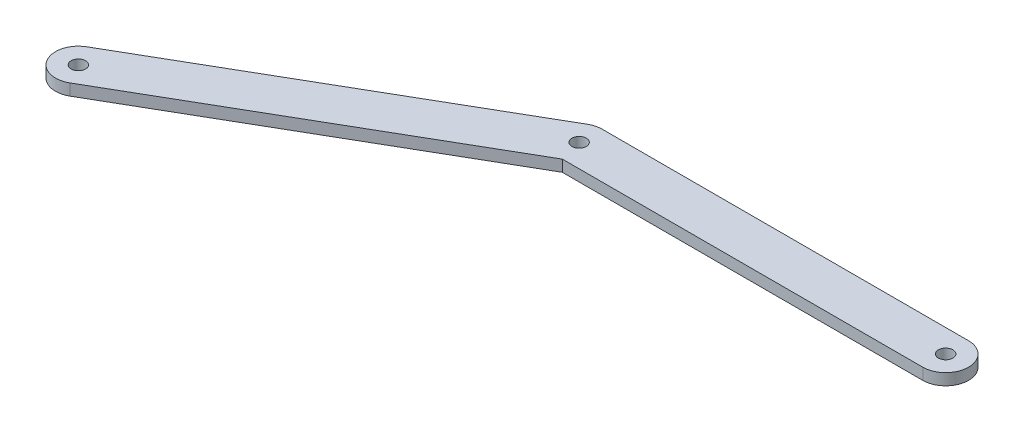
ISO-10303-21;
HEADER;
FILE_DESCRIPTION(('STEP AP214'),'2;1');
FILE_NAME('part.step','',(''),(''),'','','');
FILE_SCHEMA(('AUTOMOTIVE_DESIGN { 1 0 10303 214 1 1 1 1 }'));
ENDSEC;
DATA;
#1=APPLICATION_CONTEXT('core data for automotive mechanical design processes');
#2=APPLICATION_PROTOCOL_DEFINITION('international standard','automotive_design',2000,#1);
#3=PRODUCT_CONTEXT('',#1,'mechanical');
#4=PRODUCT('Part','Part','',(#3));
#5=PRODUCT_RELATED_PRODUCT_CATEGORY('part','',(#4));
#6=PRODUCT_DEFINITION_FORMATION('','',#4);
#7=PRODUCT_DEFINITION_CONTEXT('part definition',#1,'design');
#8=PRODUCT_DEFINITION('design','',#6,#7);
#9=PRODUCT_DEFINITION_SHAPE('','',#8);
#10=(LENGTH_UNIT() NAMED_UNIT(*) SI_UNIT(.MILLI.,.METRE.));
#11=(NAMED_UNIT(*) PLANE_ANGLE_UNIT() SI_UNIT($,.RADIAN.));
#12=(NAMED_UNIT(*) SI_UNIT($,.STERADIAN.) SOLID_ANGLE_UNIT());
#13=UNCERTAINTY_MEASURE_WITH_UNIT(LENGTH_MEASURE(1.E-05),#10,'distance_accuracy_value','');
#14=(GEOMETRIC_REPRESENTATION_CONTEXT(3) GLOBAL_UNCERTAINTY_ASSIGNED_CONTEXT((#13)) GLOBAL_UNIT_ASSIGNED_CONTEXT((#10,
#11,#12)) REPRESENTATION_CONTEXT('',''));
#15=CARTESIAN_POINT('',(0.,0.,0.));
#16=DIRECTION('',(0.,0.,1.));
#17=DIRECTION('',(1.,0.,0.));
#18=AXIS2_PLACEMENT_3D('',#15,#16,#17);
#19=CARTESIAN_POINT('',(-50.8,3.175,0.));
#20=DIRECTION('',(0.,-1.,0.));
#21=DIRECTION('',(0.,0.,-1.));
#22=AXIS2_PLACEMENT_3D('',#19,#20,#21);
#23=CYLINDRICAL_SURFACE('',#22,6.35);
#24=DIRECTION('',(0.,-1.,0.));
#25=VECTOR('',#24,1.);
#26=CARTESIAN_POINT('',(-53.975,3.175,-5.49926131403119));
#27=LINE('',#26,#25);
#28=CARTESIAN_POINT('',(-53.975,3.175,-5.49926131403118));
#29=VERTEX_POINT('',#28);
#30=CARTESIAN_POINT('',(-53.975,0.,-5.49926131403118));
#31=VERTEX_POINT('',#30);
#32=EDGE_CURVE('E52',#29,#31,#27,.T.);
#33=ORIENTED_EDGE('',*,*,#32,.F.);
#34=CARTESIAN_POINT('',(-50.8,3.175,0.));
#35=DIRECTION('',(0.,1.,0.));
#36=DIRECTION('',(0.,0.,1.));
#37=AXIS2_PLACEMENT_3D('',#34,#35,#36);
#38=CIRCLE('',#37,6.35);
#39=CARTESIAN_POINT('',(-50.8,3.175,-6.35));
#40=VERTEX_POINT('',#39);
#41=EDGE_CURVE('E130',#40,#29,#38,.T.);
#42=ORIENTED_EDGE('',*,*,#41,.F.);
#43=DIRECTION('',(0.,-1.,0.));
#44=VECTOR('',#43,1.);
#45=CARTESIAN_POINT('',(-50.8,3.175,-6.35));
#46=LINE('',#45,#44);
#47=CARTESIAN_POINT('',(-50.8,0.,-6.35));
#48=VERTEX_POINT('',#47);
#49=EDGE_CURVE('E139',#40,#48,#46,.T.);
#50=ORIENTED_EDGE('',*,*,#49,.T.);
#51=CARTESIAN_POINT('',(-50.8,0.,0.));
#52=DIRECTION('',(0.,1.,0.));
#53=DIRECTION('',(0.,0.,1.));
#54=AXIS2_PLACEMENT_3D('',#51,#52,#53);
#55=CIRCLE('',#54,6.35);
#56=EDGE_CURVE('E57',#48,#31,#55,.T.);
#57=ORIENTED_EDGE('',*,*,#56,.T.);
#58=EDGE_LOOP('',(#33,#42,#50,#57));
#59=FACE_BOUND('',#58,.T.);
#60=ADVANCED_FACE('F37',(#59),#23,.T.);
#61=CARTESIAN_POINT('',(-50.8,3.175,6.35));
#62=DIRECTION('',(0.,0.,-1.));
#63=DIRECTION('',(-1.,0.,0.));
#64=AXIS2_PLACEMENT_3D('',#61,#62,#63);
#65=PLANE('',#64);
#66=DIRECTION('',(0.,1.,0.));
#67=VECTOR('',#66,1.);
#68=CARTESIAN_POINT('',(-49.0985226280623,3.175,6.35));
#69=LINE('',#68,#67);
#70=CARTESIAN_POINT('',(-49.0985226280623,0.,6.35));
#71=VERTEX_POINT('',#70);
#72=CARTESIAN_POINT('',(-49.0985226280624,3.175,6.35000000000001));
#73=VERTEX_POINT('',#72);
#74=EDGE_CURVE('E11',#71,#73,#69,.T.);
#75=ORIENTED_EDGE('',*,*,#74,.F.);
#76=DIRECTION('',(1.,0.,0.));
#77=VECTOR('',#76,1.);
#78=CARTESIAN_POINT('',(-50.8,0.,6.35));
#79=LINE('',#78,#77);
#80=CARTESIAN_POINT('',(50.8,0.,6.34999999999998));
#81=VERTEX_POINT('',#80);
#82=EDGE_CURVE('E141',#71,#81,#79,.T.);
#83=ORIENTED_EDGE('',*,*,#82,.T.);
#84=DIRECTION('',(0.,-1.,0.));
#85=VECTOR('',#84,1.);
#86=CARTESIAN_POINT('',(50.8,3.175,6.34999999999998));
#87=LINE('',#86,#85);
#88=CARTESIAN_POINT('',(50.8,3.175,6.34999999999998));
#89=VERTEX_POINT('',#88);
#90=EDGE_CURVE('E45',#89,#81,#87,.T.);
#91=ORIENTED_EDGE('',*,*,#90,.F.);
#92=DIRECTION('',(1.,0.,0.));
#93=VECTOR('',#92,1.);
#94=CARTESIAN_POINT('',(-50.8,3.175,6.35));
#95=LINE('',#94,#93);
#96=EDGE_CURVE('E132',#73,#89,#95,.T.);
#97=ORIENTED_EDGE('',*,*,#96,.F.);
#98=EDGE_LOOP('',(#75,#83,#91,#97));
#99=FACE_BOUND('',#98,.T.);
#100=ADVANCED_FACE('F200',(#99),#65,.F.);
#101=CARTESIAN_POINT('',(-50.8,3.175,0.));
#102=DIRECTION('',(0.,1.,0.));
#103=DIRECTION('',(0.,0.,1.));
#104=AXIS2_PLACEMENT_3D('',#101,#102,#103);
#105=PLANE('',#104);
#106=CARTESIAN_POINT('',(-50.8,3.175,0.));
#107=DIRECTION('',(0.,1.,0.));
#108=DIRECTION('',(0.,0.,1.));
#109=AXIS2_PLACEMENT_3D('',#106,#107,#108);
#110=CIRCLE('',#109,2.000000064);
#111=CARTESIAN_POINT('',(-50.8,3.175,2.000000064));
#112=VERTEX_POINT('',#111);
#113=EDGE_CURVE('E182',#112,#112,#110,.F.);
#114=ORIENTED_EDGE('',*,*,#113,.T.);
#115=EDGE_LOOP('',(#114));
#116=FACE_BOUND('',#115,.T.);
#117=DIRECTION('',(0.866025403784438,0.,-0.500000000000001));
#118=VECTOR('',#117,1.);
#119=CARTESIAN_POINT('',(-135.613181024499,3.175,56.2992613140313));
#120=LINE('',#119,#118);
#121=CARTESIAN_POINT('',(-135.613181024499,3.175,56.2992613140313));
#122=VERTEX_POINT('',#121);
#123=EDGE_CURVE('E96',#122,#73,#120,.T.);
#124=ORIENTED_EDGE('',*,*,#123,.T.);
#125=ORIENTED_EDGE('',*,*,#96,.T.);
#126=CARTESIAN_POINT('',(50.8,3.175,0.));
#127=DIRECTION('',(0.,1.,0.));
#128=DIRECTION('',(0.,0.,1.));
#129=AXIS2_PLACEMENT_3D('',#126,#127,#128);
#130=CIRCLE('',#129,6.35);
#131=CARTESIAN_POINT('',(50.8,3.175,-6.35000000000002));
#132=VERTEX_POINT('',#131);
#133=EDGE_CURVE('E135',#89,#132,#130,.T.);
#134=ORIENTED_EDGE('',*,*,#133,.T.);
#135=DIRECTION('',(-1.,0.,0.));
#136=VECTOR('',#135,1.);
#137=CARTESIAN_POINT('',(-50.8,3.175,-6.35));
#138=LINE('',#137,#136);
#139=EDGE_CURVE('E137',#132,#40,#138,.T.);
#140=ORIENTED_EDGE('',*,*,#139,.T.);
#141=ORIENTED_EDGE('',*,*,#41,.T.);
#142=DIRECTION('',(-0.866025403784438,0.,0.500000000000001));
#143=VECTOR('',#142,1.);
#144=CARTESIAN_POINT('',(-141.963181024499,3.175,45.300738685969));
#145=LINE('',#144,#143);
#146=CARTESIAN_POINT('',(-141.963181024499,3.175,45.300738685969));
#147=VERTEX_POINT('',#146);
#148=EDGE_CURVE('E104',#29,#147,#145,.T.);
#149=ORIENTED_EDGE('',*,*,#148,.T.);
#150=CARTESIAN_POINT('',(-138.788181024499,3.175,50.8000000000001));
#151=DIRECTION('',(0.,1.,0.));
#152=DIRECTION('',(0.,0.,1.));
#153=AXIS2_PLACEMENT_3D('',#150,#151,#152);
#154=CIRCLE('',#153,6.34999999999998);
#155=EDGE_CURVE('E105',#147,#122,#154,.T.);
#156=ORIENTED_EDGE('',*,*,#155,.T.);
#157=EDGE_LOOP('',(#124,#125,#134,#140,#141,#149,#156));
#158=FACE_BOUND('',#157,.T.);
#159=CARTESIAN_POINT('',(-138.788181024499,3.175,50.8000000000001));
#160=DIRECTION('',(0.,1.,0.));
#161=DIRECTION('',(0.,0.,1.));
#162=AXIS2_PLACEMENT_3D('',#159,#160,#161);
#163=CIRCLE('',#162,2.00000006400001);
#164=CARTESIAN_POINT('',(-138.788181024499,3.175,52.8000000640001));
#165=VERTEX_POINT('',#164);
#166=EDGE_CURVE('E174',#165,#165,#163,.T.);
#167=ORIENTED_EDGE('',*,*,#166,.F.);
#168=EDGE_LOOP('',(#167));
#169=FACE_BOUND('',#168,.T.);
#170=CARTESIAN_POINT('',(50.8,3.175,0.));
#171=DIRECTION('',(0.,1.,0.));
#172=DIRECTION('',(0.,0.,1.));
#173=AXIS2_PLACEMENT_3D('',#170,#171,#172);
#174=CIRCLE('',#173,2.000000064);
#175=CARTESIAN_POINT('',(50.8,3.175,2.00000006399998));
#176=VERTEX_POINT('',#175);
#177=EDGE_CURVE('E122',#176,#176,#174,.T.);
#178=ORIENTED_EDGE('',*,*,#177,.F.);
#179=EDGE_LOOP('',(#178));
#180=FACE_BOUND('',#179,.T.);
#181=ADVANCED_FACE('F108',(#116,#158,#169,#180),#105,.T.);
#182=CARTESIAN_POINT('',(-50.8,0.,0.));
#183=DIRECTION('',(0.,1.,0.));
#184=DIRECTION('',(0.,0.,1.));
#185=AXIS2_PLACEMENT_3D('',#182,#183,#184);
#186=PLANE('',#185);
#187=CARTESIAN_POINT('',(-50.8,0.,0.));
#188=DIRECTION('',(0.,1.,0.));
#189=DIRECTION('',(0.,0.,1.));
#190=AXIS2_PLACEMENT_3D('',#187,#188,#189);
#191=CIRCLE('',#190,2.000000064);
#192=CARTESIAN_POINT('',(-50.8,0.,2.000000064));
#193=VERTEX_POINT('',#192);
#194=EDGE_CURVE('E40',#193,#193,#191,.F.);
#195=ORIENTED_EDGE('',*,*,#194,.F.);
#196=EDGE_LOOP('',(#195));
#197=FACE_BOUND('',#196,.T.);
#198=ORIENTED_EDGE('',*,*,#82,.F.);
#199=DIRECTION('',(0.866025403784438,0.,-0.500000000000001));
#200=VECTOR('',#199,1.);
#201=CARTESIAN_POINT('',(-135.613181024499,0.,56.2992613140313));
#202=LINE('',#201,#200);
#203=CARTESIAN_POINT('',(-135.613181024499,0.,56.2992613140313));
#204=VERTEX_POINT('',#203);
#205=EDGE_CURVE('E173',#204,#71,#202,.T.);
#206=ORIENTED_EDGE('',*,*,#205,.F.);
#207=CARTESIAN_POINT('',(-138.788181024499,0.,50.8000000000001));
#208=DIRECTION('',(0.,1.,0.));
#209=DIRECTION('',(0.,0.,1.));
#210=AXIS2_PLACEMENT_3D('',#207,#208,#209);
#211=CIRCLE('',#210,6.34999999999998);
#212=CARTESIAN_POINT('',(-141.963181024499,0.,45.300738685969));
#213=VERTEX_POINT('',#212);
#214=EDGE_CURVE('E118',#213,#204,#211,.T.);
#215=ORIENTED_EDGE('',*,*,#214,.F.);
#216=DIRECTION('',(-0.866025403784438,0.,0.500000000000001));
#217=VECTOR('',#216,1.);
#218=CARTESIAN_POINT('',(-141.963181024499,0.,45.300738685969));
#219=LINE('',#218,#217);
#220=EDGE_CURVE('E114',#31,#213,#219,.T.);
#221=ORIENTED_EDGE('',*,*,#220,.F.);
#222=ORIENTED_EDGE('',*,*,#56,.F.);
#223=DIRECTION('',(-1.,0.,0.));
#224=VECTOR('',#223,1.);
#225=CARTESIAN_POINT('',(-50.8,0.,-6.35));
#226=LINE('',#225,#224);
#227=CARTESIAN_POINT('',(50.8,0.,-6.35000000000002));
#228=VERTEX_POINT('',#227);
#229=EDGE_CURVE('E133',#228,#48,#226,.T.);
#230=ORIENTED_EDGE('',*,*,#229,.F.);
#231=CARTESIAN_POINT('',(50.8,0.,0.));
#232=DIRECTION('',(0.,1.,0.));
#233=DIRECTION('',(0.,0.,1.));
#234=AXIS2_PLACEMENT_3D('',#231,#232,#233);
#235=CIRCLE('',#234,6.35);
#236=EDGE_CURVE('E143',#81,#228,#235,.T.);
#237=ORIENTED_EDGE('',*,*,#236,.F.);
#238=EDGE_LOOP('',(#198,#206,#215,#221,#222,#230,#237));
#239=FACE_BOUND('',#238,.T.);
#240=CARTESIAN_POINT('',(-138.788181024499,0.,50.8000000000001));
#241=DIRECTION('',(0.,1.,0.));
#242=DIRECTION('',(0.,0.,1.));
#243=AXIS2_PLACEMENT_3D('',#240,#241,#242);
#244=CIRCLE('',#243,2.00000006400001);
#245=CARTESIAN_POINT('',(-138.788181024499,0.,52.8000000640001));
#246=VERTEX_POINT('',#245);
#247=EDGE_CURVE('E177',#246,#246,#244,.T.);
#248=ORIENTED_EDGE('',*,*,#247,.T.);
#249=EDGE_LOOP('',(#248));
#250=FACE_BOUND('',#249,.T.);
#251=CARTESIAN_POINT('',(50.8,0.,0.));
#252=DIRECTION('',(0.,1.,0.));
#253=DIRECTION('',(0.,0.,1.));
#254=AXIS2_PLACEMENT_3D('',#251,#252,#253);
#255=CIRCLE('',#254,2.000000064);
#256=CARTESIAN_POINT('',(50.8,0.,2.00000006399998));
#257=VERTEX_POINT('',#256);
#258=EDGE_CURVE('E119',#257,#257,#255,.T.);
#259=ORIENTED_EDGE('',*,*,#258,.T.);
#260=EDGE_LOOP('',(#259));
#261=FACE_BOUND('',#260,.T.);
#262=ADVANCED_FACE('F161',(#197,#239,#250,#261),#186,.F.);
#263=CARTESIAN_POINT('',(50.8,3.175,0.));
#264=DIRECTION('',(0.,-1.,0.));
#265=DIRECTION('',(0.,0.,-1.));
#266=AXIS2_PLACEMENT_3D('',#263,#264,#265);
#267=CYLINDRICAL_SURFACE('',#266,6.35);
#268=ORIENTED_EDGE('',*,*,#236,.T.);
#269=DIRECTION('',(0.,-1.,0.));
#270=VECTOR('',#269,1.);
#271=CARTESIAN_POINT('',(50.8,3.175,-6.35000000000002));
#272=LINE('',#271,#270);
#273=EDGE_CURVE('E147',#132,#228,#272,.T.);
#274=ORIENTED_EDGE('',*,*,#273,.F.);
#275=ORIENTED_EDGE('',*,*,#133,.F.);
#276=ORIENTED_EDGE('',*,*,#90,.T.);
#277=EDGE_LOOP('',(#268,#274,#275,#276));
#278=FACE_BOUND('',#277,.T.);
#279=ADVANCED_FACE('F155',(#278),#267,.T.);
#280=CARTESIAN_POINT('',(-50.8,3.175,-6.35));
#281=DIRECTION('',(0.,0.,1.));
#282=DIRECTION('',(1.,0.,0.));
#283=AXIS2_PLACEMENT_3D('',#280,#281,#282);
#284=PLANE('',#283);
#285=ORIENTED_EDGE('',*,*,#229,.T.);
#286=ORIENTED_EDGE('',*,*,#49,.F.);
#287=ORIENTED_EDGE('',*,*,#139,.F.);
#288=ORIENTED_EDGE('',*,*,#273,.T.);
#289=EDGE_LOOP('',(#285,#286,#287,#288));
#290=FACE_BOUND('',#289,.T.);
#291=ADVANCED_FACE('F166',(#290),#284,.F.);
#292=CARTESIAN_POINT('',(50.8,3.175,0.));
#293=DIRECTION('',(0.,-1.,0.));
#294=DIRECTION('',(0.,0.,-1.));
#295=AXIS2_PLACEMENT_3D('',#292,#293,#294);
#296=CYLINDRICAL_SURFACE('',#295,2.000000064);
#297=ORIENTED_EDGE('',*,*,#177,.T.);
#298=EDGE_LOOP('',(#297));
#299=FACE_BOUND('',#298,.T.);
#300=ORIENTED_EDGE('',*,*,#258,.F.);
#301=EDGE_LOOP('',(#300));
#302=FACE_BOUND('',#301,.T.);
#303=ADVANCED_FACE('F210',(#299,#302),#296,.F.);
#304=CARTESIAN_POINT('',(-135.613181024499,3.175,56.2992613140313));
#305=DIRECTION('',(-0.500000000000001,0.,-0.866025403784438));
#306=DIRECTION('',(-0.866025403784438,0.,0.500000000000001));
#307=AXIS2_PLACEMENT_3D('',#304,#305,#306);
#308=PLANE('',#307);
#309=ORIENTED_EDGE('',*,*,#205,.T.);
#310=ORIENTED_EDGE('',*,*,#74,.T.);
#311=ORIENTED_EDGE('',*,*,#123,.F.);
#312=DIRECTION('',(0.,-1.,0.));
#313=VECTOR('',#312,1.);
#314=CARTESIAN_POINT('',(-135.613181024499,3.175,56.2992613140313));
#315=LINE('',#314,#313);
#316=EDGE_CURVE('E101',#122,#204,#315,.T.);
#317=ORIENTED_EDGE('',*,*,#316,.T.);
#318=EDGE_LOOP('',(#309,#310,#311,#317));
#319=FACE_BOUND('',#318,.T.);
#320=ADVANCED_FACE('F99',(#319),#308,.F.);
#321=CARTESIAN_POINT('',(-138.788181024499,3.175,50.8000000000001));
#322=DIRECTION('',(0.,-1.,0.));
#323=DIRECTION('',(0.,0.,-1.));
#324=AXIS2_PLACEMENT_3D('',#321,#322,#323);
#325=CYLINDRICAL_SURFACE('',#324,6.34999999999998);
#326=ORIENTED_EDGE('',*,*,#214,.T.);
#327=ORIENTED_EDGE('',*,*,#316,.F.);
#328=ORIENTED_EDGE('',*,*,#155,.F.);
#329=DIRECTION('',(0.,-1.,0.));
#330=VECTOR('',#329,1.);
#331=CARTESIAN_POINT('',(-141.963181024499,3.175,45.300738685969));
#332=LINE('',#331,#330);
#333=EDGE_CURVE('E124',#147,#213,#332,.T.);
#334=ORIENTED_EDGE('',*,*,#333,.T.);
#335=EDGE_LOOP('',(#326,#327,#328,#334));
#336=FACE_BOUND('',#335,.T.);
#337=ADVANCED_FACE('F116',(#336),#325,.T.);
#338=CARTESIAN_POINT('',(-141.963181024499,3.175,45.300738685969));
#339=DIRECTION('',(0.500000000000001,0.,0.866025403784438));
#340=DIRECTION('',(0.866025403784438,0.,-0.500000000000002));
#341=AXIS2_PLACEMENT_3D('',#338,#339,#340);
#342=PLANE('',#341);
#343=ORIENTED_EDGE('',*,*,#220,.T.);
#344=ORIENTED_EDGE('',*,*,#333,.F.);
#345=ORIENTED_EDGE('',*,*,#148,.F.);
#346=ORIENTED_EDGE('',*,*,#32,.T.);
#347=EDGE_LOOP('',(#343,#344,#345,#346));
#348=FACE_BOUND('',#347,.T.);
#349=ADVANCED_FACE('F169',(#348),#342,.F.);
#350=CARTESIAN_POINT('',(-138.788181024499,3.175,50.8000000000001));
#351=DIRECTION('',(0.,-1.,0.));
#352=DIRECTION('',(0.,0.,-1.));
#353=AXIS2_PLACEMENT_3D('',#350,#351,#352);
#354=CYLINDRICAL_SURFACE('',#353,2.00000006400001);
#355=ORIENTED_EDGE('',*,*,#166,.T.);
#356=EDGE_LOOP('',(#355));
#357=FACE_BOUND('',#356,.T.);
#358=ORIENTED_EDGE('',*,*,#247,.F.);
#359=EDGE_LOOP('',(#358));
#360=FACE_BOUND('',#359,.T.);
#361=ADVANCED_FACE('F226',(#357,#360),#354,.F.);
#362=CARTESIAN_POINT('',(-50.8,3.81,0.));
#363=DIRECTION('',(0.,-1.,0.));
#364=DIRECTION('',(0.,0.,-1.));
#365=AXIS2_PLACEMENT_3D('',#362,#363,#364);
#366=CYLINDRICAL_SURFACE('',#365,2.000000064);
#367=ORIENTED_EDGE('',*,*,#113,.F.);
#368=EDGE_LOOP('',(#367));
#369=FACE_BOUND('',#368,.T.);
#370=ORIENTED_EDGE('',*,*,#194,.T.);
#371=EDGE_LOOP('',(#370));
#372=FACE_BOUND('',#371,.T.);
#373=ADVANCED_FACE('F191',(#369,#372),#366,.F.);
#374=CLOSED_SHELL('',(#60,#100,#181,#262,#279,#291,#303,#320,#337,#349,#361,#373));
#375=MANIFOLD_SOLID_BREP('B2',#374);
#376=ADVANCED_BREP_SHAPE_REPRESENTATION('',(#18,#375),#14);
#377=SHAPE_DEFINITION_REPRESENTATION(#9,#376);
ENDSEC;
END-ISO-10303-21;
